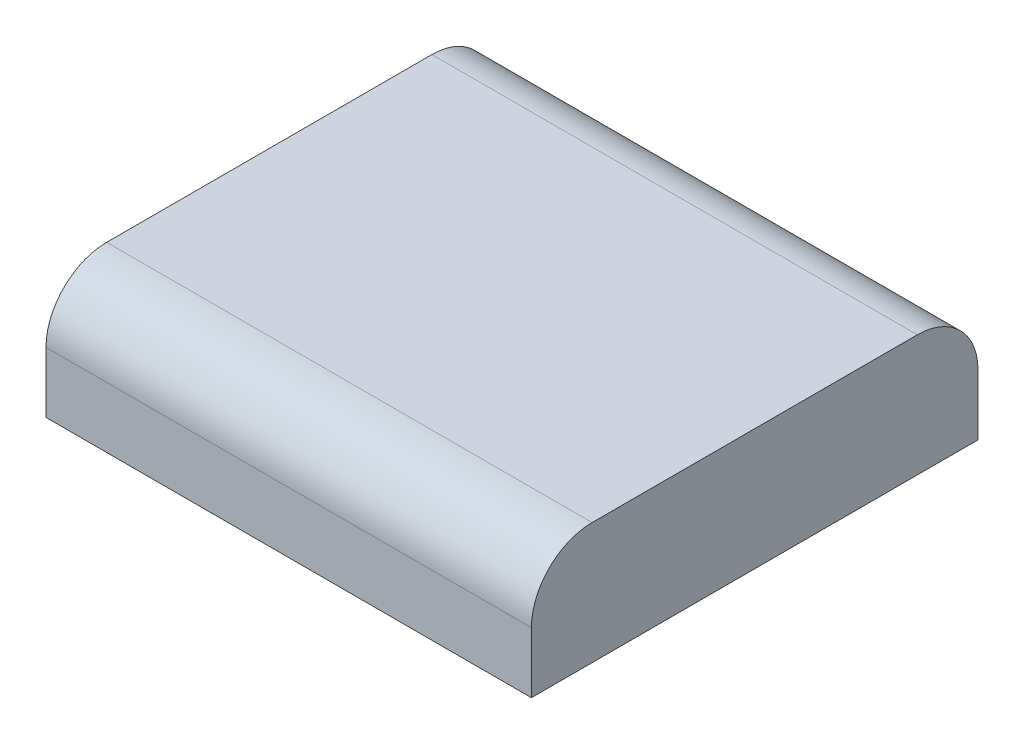
ISO-10303-21;
HEADER;
FILE_DESCRIPTION(('STEP AP214'),'2;1');
FILE_NAME('part.step','',(''),(''),'','','');
FILE_SCHEMA(('AUTOMOTIVE_DESIGN { 1 0 10303 214 1 1 1 1 }'));
ENDSEC;
DATA;
#1=APPLICATION_CONTEXT('core data for automotive mechanical design processes');
#2=APPLICATION_PROTOCOL_DEFINITION('international standard','automotive_design',2000,#1);
#3=PRODUCT_CONTEXT('',#1,'mechanical');
#4=PRODUCT('Part','Part','',(#3));
#5=PRODUCT_RELATED_PRODUCT_CATEGORY('part','',(#4));
#6=PRODUCT_DEFINITION_FORMATION('','',#4);
#7=PRODUCT_DEFINITION_CONTEXT('part definition',#1,'design');
#8=PRODUCT_DEFINITION('design','',#6,#7);
#9=PRODUCT_DEFINITION_SHAPE('','',#8);
#10=(LENGTH_UNIT() NAMED_UNIT(*) SI_UNIT(.MILLI.,.METRE.));
#11=(NAMED_UNIT(*) PLANE_ANGLE_UNIT() SI_UNIT($,.RADIAN.));
#12=(NAMED_UNIT(*) SI_UNIT($,.STERADIAN.) SOLID_ANGLE_UNIT());
#13=UNCERTAINTY_MEASURE_WITH_UNIT(LENGTH_MEASURE(1.E-05),#10,'distance_accuracy_value','');
#14=(GEOMETRIC_REPRESENTATION_CONTEXT(3) GLOBAL_UNCERTAINTY_ASSIGNED_CONTEXT((#13)) GLOBAL_UNIT_ASSIGNED_CONTEXT((#10,
#11,#12)) REPRESENTATION_CONTEXT('',''));
#15=CARTESIAN_POINT('',(0.,0.,0.));
#16=DIRECTION('',(0.,0.,1.));
#17=DIRECTION('',(1.,0.,0.));
#18=AXIS2_PLACEMENT_3D('',#15,#16,#17);
#19=CARTESIAN_POINT('',(31.75,15.875,29.21));
#20=DIRECTION('',(-1.,0.,0.));
#21=DIRECTION('',(0.,0.,1.));
#22=AXIS2_PLACEMENT_3D('',#19,#20,#21);
#23=PLANE('',#22);
#24=DIRECTION('',(0.,-1.,0.));
#25=VECTOR('',#24,1.);
#26=CARTESIAN_POINT('',(31.75,15.875,-29.21));
#27=LINE('',#26,#25);
#28=CARTESIAN_POINT('',(31.75,7.9375,-29.21));
#29=VERTEX_POINT('',#28);
#30=CARTESIAN_POINT('',(31.75,0.,-29.21));
#31=VERTEX_POINT('',#30);
#32=EDGE_CURVE('E91',#29,#31,#27,.T.);
#33=ORIENTED_EDGE('',*,*,#32,.F.);
#34=CARTESIAN_POINT('',(31.75,7.9375,-21.2725));
#35=DIRECTION('',(-1.,0.,0.));
#36=DIRECTION('',(0.,0.,1.));
#37=AXIS2_PLACEMENT_3D('',#34,#35,#36);
#38=CIRCLE('',#37,7.9375);
#39=CARTESIAN_POINT('',(31.75,15.875,-21.2725));
#40=VERTEX_POINT('',#39);
#41=EDGE_CURVE('E48',#29,#40,#38,.F.);
#42=ORIENTED_EDGE('',*,*,#41,.T.);
#43=DIRECTION('',(0.,0.,-1.));
#44=VECTOR('',#43,1.);
#45=CARTESIAN_POINT('',(31.75,15.875,29.21));
#46=LINE('',#45,#44);
#47=CARTESIAN_POINT('',(31.75,15.875,21.2725));
#48=VERTEX_POINT('',#47);
#49=EDGE_CURVE('E124',#48,#40,#46,.T.);
#50=ORIENTED_EDGE('',*,*,#49,.F.);
#51=CARTESIAN_POINT('',(31.75,7.9375,21.2725));
#52=DIRECTION('',(-1.,0.,0.));
#53=DIRECTION('',(0.,0.,1.));
#54=AXIS2_PLACEMENT_3D('',#51,#52,#53);
#55=CIRCLE('',#54,7.9375);
#56=CARTESIAN_POINT('',(31.75,7.9375,29.21));
#57=VERTEX_POINT('',#56);
#58=EDGE_CURVE('E55',#48,#57,#55,.F.);
#59=ORIENTED_EDGE('',*,*,#58,.T.);
#60=DIRECTION('',(0.,-1.,0.));
#61=VECTOR('',#60,1.);
#62=CARTESIAN_POINT('',(31.75,15.875,29.21));
#63=LINE('',#62,#61);
#64=CARTESIAN_POINT('',(31.75,0.,29.21));
#65=VERTEX_POINT('',#64);
#66=EDGE_CURVE('E111',#57,#65,#63,.T.);
#67=ORIENTED_EDGE('',*,*,#66,.T.);
#68=DIRECTION('',(0.,0.,-1.));
#69=VECTOR('',#68,1.);
#70=CARTESIAN_POINT('',(31.75,0.,29.21));
#71=LINE('',#70,#69);
#72=EDGE_CURVE('E106',#65,#31,#71,.T.);
#73=ORIENTED_EDGE('',*,*,#72,.T.);
#74=EDGE_LOOP('',(#33,#42,#50,#59,#67,#73));
#75=FACE_BOUND('',#74,.T.);
#76=ADVANCED_FACE('F39',(#75),#23,.F.);
#77=CARTESIAN_POINT('',(-31.75,15.875,-29.21));
#78=DIRECTION('',(0.,0.,1.));
#79=DIRECTION('',(1.,0.,0.));
#80=AXIS2_PLACEMENT_3D('',#77,#78,#79);
#81=PLANE('',#80);
#82=DIRECTION('',(0.,-1.,0.));
#83=VECTOR('',#82,1.);
#84=CARTESIAN_POINT('',(-31.75,15.875,-29.21));
#85=LINE('',#84,#83);
#86=CARTESIAN_POINT('',(-31.75,7.9375,-29.21));
#87=VERTEX_POINT('',#86);
#88=CARTESIAN_POINT('',(-31.75,0.,-29.21));
#89=VERTEX_POINT('',#88);
#90=EDGE_CURVE('E100',#87,#89,#85,.T.);
#91=ORIENTED_EDGE('',*,*,#90,.F.);
#92=DIRECTION('',(-1.,0.,0.));
#93=VECTOR('',#92,1.);
#94=CARTESIAN_POINT('',(-31.75,7.9375,-29.21));
#95=LINE('',#94,#93);
#96=EDGE_CURVE('E63',#87,#29,#95,.F.);
#97=ORIENTED_EDGE('',*,*,#96,.T.);
#98=ORIENTED_EDGE('',*,*,#32,.T.);
#99=DIRECTION('',(-1.,0.,0.));
#100=VECTOR('',#99,1.);
#101=CARTESIAN_POINT('',(-31.75,0.,-29.21));
#102=LINE('',#101,#100);
#103=EDGE_CURVE('E94',#31,#89,#102,.T.);
#104=ORIENTED_EDGE('',*,*,#103,.T.);
#105=EDGE_LOOP('',(#91,#97,#98,#104));
#106=FACE_BOUND('',#105,.T.);
#107=ADVANCED_FACE('F93',(#106),#81,.F.);
#108=CARTESIAN_POINT('',(-31.75,15.875,29.21));
#109=DIRECTION('',(1.,0.,0.));
#110=DIRECTION('',(0.,0.,-1.));
#111=AXIS2_PLACEMENT_3D('',#108,#109,#110);
#112=PLANE('',#111);
#113=DIRECTION('',(0.,0.,1.));
#114=VECTOR('',#113,1.);
#115=CARTESIAN_POINT('',(-31.75,15.875,29.21));
#116=LINE('',#115,#114);
#117=CARTESIAN_POINT('',(-31.75,15.875,-21.2725));
#118=VERTEX_POINT('',#117);
#119=CARTESIAN_POINT('',(-31.75,15.875,21.2725));
#120=VERTEX_POINT('',#119);
#121=EDGE_CURVE('E116',#118,#120,#116,.T.);
#122=ORIENTED_EDGE('',*,*,#121,.F.);
#123=CARTESIAN_POINT('',(-31.75,7.9375,-21.2725));
#124=DIRECTION('',(1.,0.,0.));
#125=DIRECTION('',(0.,0.,-1.));
#126=AXIS2_PLACEMENT_3D('',#123,#124,#125);
#127=CIRCLE('',#126,7.9375);
#128=EDGE_CURVE('E142',#118,#87,#127,.F.);
#129=ORIENTED_EDGE('',*,*,#128,.T.);
#130=ORIENTED_EDGE('',*,*,#90,.T.);
#131=DIRECTION('',(0.,0.,1.));
#132=VECTOR('',#131,1.);
#133=CARTESIAN_POINT('',(-31.75,0.,29.21));
#134=LINE('',#133,#132);
#135=CARTESIAN_POINT('',(-31.75,0.,29.21));
#136=VERTEX_POINT('',#135);
#137=EDGE_CURVE('E108',#89,#136,#134,.T.);
#138=ORIENTED_EDGE('',*,*,#137,.T.);
#139=DIRECTION('',(0.,-1.,0.));
#140=VECTOR('',#139,1.);
#141=CARTESIAN_POINT('',(-31.75,15.875,29.21));
#142=LINE('',#141,#140);
#143=CARTESIAN_POINT('',(-31.75,7.9375,29.21));
#144=VERTEX_POINT('',#143);
#145=EDGE_CURVE('E127',#144,#136,#142,.T.);
#146=ORIENTED_EDGE('',*,*,#145,.F.);
#147=CARTESIAN_POINT('',(-31.75,7.9375,21.2725));
#148=DIRECTION('',(1.,0.,0.));
#149=DIRECTION('',(0.,0.,-1.));
#150=AXIS2_PLACEMENT_3D('',#147,#148,#149);
#151=CIRCLE('',#150,7.9375);
#152=EDGE_CURVE('E139',#144,#120,#151,.F.);
#153=ORIENTED_EDGE('',*,*,#152,.T.);
#154=EDGE_LOOP('',(#122,#129,#130,#138,#146,#153));
#155=FACE_BOUND('',#154,.T.);
#156=ADVANCED_FACE('F160',(#155),#112,.F.);
#157=CARTESIAN_POINT('',(-31.75,15.875,29.21));
#158=DIRECTION('',(0.,0.,-1.));
#159=DIRECTION('',(-1.,0.,0.));
#160=AXIS2_PLACEMENT_3D('',#157,#158,#159);
#161=PLANE('',#160);
#162=ORIENTED_EDGE('',*,*,#66,.F.);
#163=DIRECTION('',(1.,0.,0.));
#164=VECTOR('',#163,1.);
#165=CARTESIAN_POINT('',(-31.75,7.9375,29.21));
#166=LINE('',#165,#164);
#167=EDGE_CURVE('E11',#57,#144,#166,.F.);
#168=ORIENTED_EDGE('',*,*,#167,.T.);
#169=ORIENTED_EDGE('',*,*,#145,.T.);
#170=DIRECTION('',(1.,0.,0.));
#171=VECTOR('',#170,1.);
#172=CARTESIAN_POINT('',(-31.75,0.,29.21));
#173=LINE('',#172,#171);
#174=EDGE_CURVE('E121',#136,#65,#173,.T.);
#175=ORIENTED_EDGE('',*,*,#174,.T.);
#176=EDGE_LOOP('',(#162,#168,#169,#175));
#177=FACE_BOUND('',#176,.T.);
#178=ADVANCED_FACE('F167',(#177),#161,.F.);
#179=CARTESIAN_POINT('',(0.,15.875,0.));
#180=DIRECTION('',(0.,-1.,0.));
#181=DIRECTION('',(0.,0.,-1.));
#182=AXIS2_PLACEMENT_3D('',#179,#180,#181);
#183=PLANE('',#182);
#184=ORIENTED_EDGE('',*,*,#49,.T.);
#185=DIRECTION('',(-1.,0.,0.));
#186=VECTOR('',#185,1.);
#187=CARTESIAN_POINT('',(0.,15.875,-21.2725));
#188=LINE('',#187,#186);
#189=EDGE_CURVE('E135',#40,#118,#188,.T.);
#190=ORIENTED_EDGE('',*,*,#189,.T.);
#191=ORIENTED_EDGE('',*,*,#121,.T.);
#192=DIRECTION('',(1.,0.,0.));
#193=VECTOR('',#192,1.);
#194=CARTESIAN_POINT('',(0.,15.875,21.2725));
#195=LINE('',#194,#193);
#196=EDGE_CURVE('E99',#120,#48,#195,.T.);
#197=ORIENTED_EDGE('',*,*,#196,.T.);
#198=EDGE_LOOP('',(#184,#190,#191,#197));
#199=FACE_BOUND('',#198,.T.);
#200=ADVANCED_FACE('F153',(#199),#183,.F.);
#201=CARTESIAN_POINT('',(0.,0.,0.));
#202=DIRECTION('',(0.,-1.,0.));
#203=DIRECTION('',(0.,0.,-1.));
#204=AXIS2_PLACEMENT_3D('',#201,#202,#203);
#205=PLANE('',#204);
#206=ORIENTED_EDGE('',*,*,#72,.F.);
#207=ORIENTED_EDGE('',*,*,#174,.F.);
#208=ORIENTED_EDGE('',*,*,#137,.F.);
#209=ORIENTED_EDGE('',*,*,#103,.F.);
#210=EDGE_LOOP('',(#206,#207,#208,#209));
#211=FACE_BOUND('',#210,.T.);
#212=ADVANCED_FACE('F104',(#211),#205,.T.);
#213=CARTESIAN_POINT('',(0.,7.9375,-21.2725));
#214=DIRECTION('',(-1.,0.,0.));
#215=DIRECTION('',(0.,0.,1.));
#216=AXIS2_PLACEMENT_3D('',#213,#214,#215);
#217=CYLINDRICAL_SURFACE('',#216,7.9375);
#218=ORIENTED_EDGE('',*,*,#41,.F.);
#219=ORIENTED_EDGE('',*,*,#96,.F.);
#220=ORIENTED_EDGE('',*,*,#128,.F.);
#221=ORIENTED_EDGE('',*,*,#189,.F.);
#222=EDGE_LOOP('',(#218,#219,#220,#221));
#223=FACE_BOUND('',#222,.T.);
#224=ADVANCED_FACE('F158',(#223),#217,.T.);
#225=CARTESIAN_POINT('',(0.,7.9375,21.2725));
#226=DIRECTION('',(1.,0.,0.));
#227=DIRECTION('',(0.,0.,-1.));
#228=AXIS2_PLACEMENT_3D('',#225,#226,#227);
#229=CYLINDRICAL_SURFACE('',#228,7.9375);
#230=ORIENTED_EDGE('',*,*,#152,.F.);
#231=ORIENTED_EDGE('',*,*,#167,.F.);
#232=ORIENTED_EDGE('',*,*,#58,.F.);
#233=ORIENTED_EDGE('',*,*,#196,.F.);
#234=EDGE_LOOP('',(#230,#231,#232,#233));
#235=FACE_BOUND('',#234,.T.);
#236=ADVANCED_FACE('F41',(#235),#229,.T.);
#237=CLOSED_SHELL('',(#76,#107,#156,#178,#200,#212,#224,#236));
#238=MANIFOLD_SOLID_BREP('B2',#237);
#239=ADVANCED_BREP_SHAPE_REPRESENTATION('',(#18,#238),#14);
#240=SHAPE_DEFINITION_REPRESENTATION(#9,#239);
ENDSEC;
END-ISO-10303-21;
